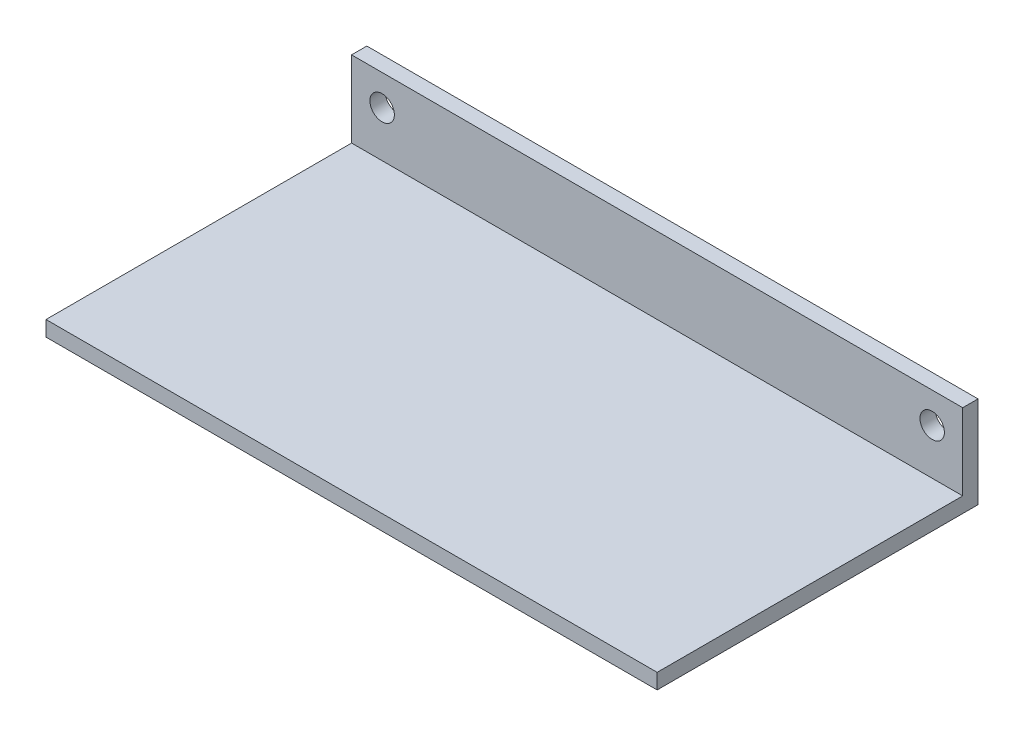
ISO-10303-21;
HEADER;
FILE_DESCRIPTION(('STEP AP214'),'2;1');
FILE_NAME('part.step','',(''),(''),'','','');
FILE_SCHEMA(('AUTOMOTIVE_DESIGN { 1 0 10303 214 1 1 1 1 }'));
ENDSEC;
DATA;
#1=APPLICATION_CONTEXT('core data for automotive mechanical design processes');
#2=APPLICATION_PROTOCOL_DEFINITION('international standard','automotive_design',2000,#1);
#3=PRODUCT_CONTEXT('',#1,'mechanical');
#4=PRODUCT('Part','Part','',(#3));
#5=PRODUCT_RELATED_PRODUCT_CATEGORY('part','',(#4));
#6=PRODUCT_DEFINITION_FORMATION('','',#4);
#7=PRODUCT_DEFINITION_CONTEXT('part definition',#1,'design');
#8=PRODUCT_DEFINITION('design','',#6,#7);
#9=PRODUCT_DEFINITION_SHAPE('','',#8);
#10=(LENGTH_UNIT() NAMED_UNIT(*) SI_UNIT(.MILLI.,.METRE.));
#11=(NAMED_UNIT(*) PLANE_ANGLE_UNIT() SI_UNIT($,.RADIAN.));
#12=(NAMED_UNIT(*) SI_UNIT($,.STERADIAN.) SOLID_ANGLE_UNIT());
#13=UNCERTAINTY_MEASURE_WITH_UNIT(LENGTH_MEASURE(1.E-05),#10,'distance_accuracy_value','');
#14=(GEOMETRIC_REPRESENTATION_CONTEXT(3) GLOBAL_UNCERTAINTY_ASSIGNED_CONTEXT((#13)) GLOBAL_UNIT_ASSIGNED_CONTEXT((#10,
#11,#12)) REPRESENTATION_CONTEXT('',''));
#15=CARTESIAN_POINT('',(0.,0.,0.));
#16=DIRECTION('',(0.,0.,1.));
#17=DIRECTION('',(1.,0.,0.));
#18=AXIS2_PLACEMENT_3D('',#15,#16,#17);
#19=CARTESIAN_POINT('',(100.,5.,50.));
#20=DIRECTION('',(-1.,0.,0.));
#21=DIRECTION('',(0.,0.,1.));
#22=AXIS2_PLACEMENT_3D('',#19,#20,#21);
#23=PLANE('',#22);
#24=DIRECTION('',(0.,0.,-1.));
#25=VECTOR('',#24,1.);
#26=CARTESIAN_POINT('',(100.,0.,50.));
#27=LINE('',#26,#25);
#28=CARTESIAN_POINT('',(100.,0.,50.));
#29=VERTEX_POINT('',#28);
#30=CARTESIAN_POINT('',(100.,0.,-55.));
#31=VERTEX_POINT('',#30);
#32=EDGE_CURVE('E88',#29,#31,#27,.T.);
#33=ORIENTED_EDGE('',*,*,#32,.T.);
#34=DIRECTION('',(0.,-1.,0.));
#35=VECTOR('',#34,1.);
#36=CARTESIAN_POINT('',(100.,30.,-55.));
#37=LINE('',#36,#35);
#38=CARTESIAN_POINT('',(100.,30.,-55.));
#39=VERTEX_POINT('',#38);
#40=EDGE_CURVE('E135',#39,#31,#37,.T.);
#41=ORIENTED_EDGE('',*,*,#40,.F.);
#42=DIRECTION('',(0.,0.,1.));
#43=VECTOR('',#42,1.);
#44=CARTESIAN_POINT('',(100.,30.,-50.));
#45=LINE('',#44,#43);
#46=CARTESIAN_POINT('',(100.,30.,-50.));
#47=VERTEX_POINT('',#46);
#48=EDGE_CURVE('E127',#39,#47,#45,.T.);
#49=ORIENTED_EDGE('',*,*,#48,.T.);
#50=DIRECTION('',(0.,-1.,0.));
#51=VECTOR('',#50,1.);
#52=CARTESIAN_POINT('',(100.,30.,-50.));
#53=LINE('',#52,#51);
#54=CARTESIAN_POINT('',(100.,5.,-50.));
#55=VERTEX_POINT('',#54);
#56=EDGE_CURVE('E89',#47,#55,#53,.T.);
#57=ORIENTED_EDGE('',*,*,#56,.T.);
#58=DIRECTION('',(0.,0.,-1.));
#59=VECTOR('',#58,1.);
#60=CARTESIAN_POINT('',(100.,5.,50.));
#61=LINE('',#60,#59);
#62=CARTESIAN_POINT('',(100.,5.,50.));
#63=VERTEX_POINT('',#62);
#64=EDGE_CURVE('E94',#63,#55,#61,.T.);
#65=ORIENTED_EDGE('',*,*,#64,.F.);
#66=DIRECTION('',(0.,-1.,0.));
#67=VECTOR('',#66,1.);
#68=CARTESIAN_POINT('',(100.,5.,50.));
#69=LINE('',#68,#67);
#70=EDGE_CURVE('E42',#63,#29,#69,.T.);
#71=ORIENTED_EDGE('',*,*,#70,.T.);
#72=EDGE_LOOP('',(#33,#41,#49,#57,#65,#71));
#73=FACE_BOUND('',#72,.T.);
#74=ADVANCED_FACE('F33',(#73),#23,.F.);
#75=CARTESIAN_POINT('',(-100.,5.,50.));
#76=DIRECTION('',(1.,0.,0.));
#77=DIRECTION('',(0.,0.,-1.));
#78=AXIS2_PLACEMENT_3D('',#75,#76,#77);
#79=PLANE('',#78);
#80=DIRECTION('',(0.,0.,1.));
#81=VECTOR('',#80,1.);
#82=CARTESIAN_POINT('',(-100.,0.,50.));
#83=LINE('',#82,#81);
#84=CARTESIAN_POINT('',(-100.,0.,-55.));
#85=VERTEX_POINT('',#84);
#86=CARTESIAN_POINT('',(-100.,0.,50.));
#87=VERTEX_POINT('',#86);
#88=EDGE_CURVE('E63',#85,#87,#83,.T.);
#89=ORIENTED_EDGE('',*,*,#88,.T.);
#90=DIRECTION('',(0.,-1.,0.));
#91=VECTOR('',#90,1.);
#92=CARTESIAN_POINT('',(-100.,5.,50.));
#93=LINE('',#92,#91);
#94=CARTESIAN_POINT('',(-100.,5.,50.));
#95=VERTEX_POINT('',#94);
#96=EDGE_CURVE('E11',#95,#87,#93,.T.);
#97=ORIENTED_EDGE('',*,*,#96,.F.);
#98=DIRECTION('',(0.,0.,1.));
#99=VECTOR('',#98,1.);
#100=CARTESIAN_POINT('',(-100.,5.,50.));
#101=LINE('',#100,#99);
#102=CARTESIAN_POINT('',(-100.,5.,-50.));
#103=VERTEX_POINT('',#102);
#104=EDGE_CURVE('E92',#103,#95,#101,.T.);
#105=ORIENTED_EDGE('',*,*,#104,.F.);
#106=DIRECTION('',(0.,-1.,0.));
#107=VECTOR('',#106,1.);
#108=CARTESIAN_POINT('',(-100.,30.,-50.));
#109=LINE('',#108,#107);
#110=CARTESIAN_POINT('',(-100.,30.,-50.));
#111=VERTEX_POINT('',#110);
#112=EDGE_CURVE('E81',#111,#103,#109,.T.);
#113=ORIENTED_EDGE('',*,*,#112,.F.);
#114=DIRECTION('',(0.,0.,-1.));
#115=VECTOR('',#114,1.);
#116=CARTESIAN_POINT('',(-100.,30.,-50.));
#117=LINE('',#116,#115);
#118=CARTESIAN_POINT('',(-100.,30.,-55.));
#119=VERTEX_POINT('',#118);
#120=EDGE_CURVE('E122',#111,#119,#117,.T.);
#121=ORIENTED_EDGE('',*,*,#120,.T.);
#122=DIRECTION('',(0.,-1.,0.));
#123=VECTOR('',#122,1.);
#124=CARTESIAN_POINT('',(-100.,30.,-55.));
#125=LINE('',#124,#123);
#126=EDGE_CURVE('E131',#119,#85,#125,.T.);
#127=ORIENTED_EDGE('',*,*,#126,.T.);
#128=EDGE_LOOP('',(#89,#97,#105,#113,#121,#127));
#129=FACE_BOUND('',#128,.T.);
#130=ADVANCED_FACE('F96',(#129),#79,.F.);
#131=CARTESIAN_POINT('',(-100.,5.,50.));
#132=DIRECTION('',(0.,0.,-1.));
#133=DIRECTION('',(-1.,0.,0.));
#134=AXIS2_PLACEMENT_3D('',#131,#132,#133);
#135=PLANE('',#134);
#136=DIRECTION('',(1.,0.,0.));
#137=VECTOR('',#136,1.);
#138=CARTESIAN_POINT('',(-100.,0.,50.));
#139=LINE('',#138,#137);
#140=EDGE_CURVE('E104',#87,#29,#139,.T.);
#141=ORIENTED_EDGE('',*,*,#140,.T.);
#142=ORIENTED_EDGE('',*,*,#70,.F.);
#143=DIRECTION('',(1.,0.,0.));
#144=VECTOR('',#143,1.);
#145=CARTESIAN_POINT('',(-100.,5.,50.));
#146=LINE('',#145,#144);
#147=EDGE_CURVE('E51',#95,#63,#146,.T.);
#148=ORIENTED_EDGE('',*,*,#147,.F.);
#149=ORIENTED_EDGE('',*,*,#96,.T.);
#150=EDGE_LOOP('',(#141,#142,#148,#149));
#151=FACE_BOUND('',#150,.T.);
#152=ADVANCED_FACE('F174',(#151),#135,.F.);
#153=CARTESIAN_POINT('',(0.,5.,0.));
#154=DIRECTION('',(0.,-1.,0.));
#155=DIRECTION('',(0.,0.,-1.));
#156=AXIS2_PLACEMENT_3D('',#153,#154,#155);
#157=PLANE('',#156);
#158=ORIENTED_EDGE('',*,*,#64,.T.);
#159=DIRECTION('',(-1.,0.,0.));
#160=VECTOR('',#159,1.);
#161=CARTESIAN_POINT('',(-100.,5.,-50.));
#162=LINE('',#161,#160);
#163=EDGE_CURVE('E72',#55,#103,#162,.T.);
#164=ORIENTED_EDGE('',*,*,#163,.T.);
#165=ORIENTED_EDGE('',*,*,#104,.T.);
#166=ORIENTED_EDGE('',*,*,#147,.T.);
#167=EDGE_LOOP('',(#158,#164,#165,#166));
#168=FACE_BOUND('',#167,.T.);
#169=ADVANCED_FACE('F91',(#168),#157,.F.);
#170=CARTESIAN_POINT('',(0.,0.,0.));
#171=DIRECTION('',(0.,-1.,0.));
#172=DIRECTION('',(0.,0.,-1.));
#173=AXIS2_PLACEMENT_3D('',#170,#171,#172);
#174=PLANE('',#173);
#175=ORIENTED_EDGE('',*,*,#32,.F.);
#176=ORIENTED_EDGE('',*,*,#140,.F.);
#177=ORIENTED_EDGE('',*,*,#88,.F.);
#178=DIRECTION('',(1.,0.,0.));
#179=VECTOR('',#178,1.);
#180=CARTESIAN_POINT('',(-100.,0.,-55.));
#181=LINE('',#180,#179);
#182=EDGE_CURVE('E113',#85,#31,#181,.T.);
#183=ORIENTED_EDGE('',*,*,#182,.T.);
#184=EDGE_LOOP('',(#175,#176,#177,#183));
#185=FACE_BOUND('',#184,.T.);
#186=ADVANCED_FACE('F148',(#185),#174,.T.);
#187=CARTESIAN_POINT('',(-100.,30.,-50.));
#188=DIRECTION('',(0.,0.,1.));
#189=DIRECTION('',(1.,0.,0.));
#190=AXIS2_PLACEMENT_3D('',#187,#188,#189);
#191=PLANE('',#190);
#192=CARTESIAN_POINT('',(-90.,20.,-50.));
#193=DIRECTION('',(0.,0.,1.));
#194=DIRECTION('',(1.,0.,0.));
#195=AXIS2_PLACEMENT_3D('',#192,#193,#194);
#196=CIRCLE('',#195,4.00000000000001);
#197=CARTESIAN_POINT('',(-86.,20.,-50.));
#198=VERTEX_POINT('',#197);
#199=EDGE_CURVE('E109',#198,#198,#196,.T.);
#200=ORIENTED_EDGE('',*,*,#199,.F.);
#201=EDGE_LOOP('',(#200));
#202=FACE_BOUND('',#201,.T.);
#203=CARTESIAN_POINT('',(90.,20.,-50.));
#204=DIRECTION('',(0.,0.,1.));
#205=DIRECTION('',(1.,0.,0.));
#206=AXIS2_PLACEMENT_3D('',#203,#204,#205);
#207=CIRCLE('',#206,4.00000000000001);
#208=CARTESIAN_POINT('',(94.,20.,-50.));
#209=VERTEX_POINT('',#208);
#210=EDGE_CURVE('E115',#209,#209,#207,.T.);
#211=ORIENTED_EDGE('',*,*,#210,.F.);
#212=EDGE_LOOP('',(#211));
#213=FACE_BOUND('',#212,.T.);
#214=ORIENTED_EDGE('',*,*,#163,.F.);
#215=ORIENTED_EDGE('',*,*,#56,.F.);
#216=DIRECTION('',(-1.,0.,0.));
#217=VECTOR('',#216,1.);
#218=CARTESIAN_POINT('',(-100.,30.,-50.));
#219=LINE('',#218,#217);
#220=EDGE_CURVE('E84',#47,#111,#219,.T.);
#221=ORIENTED_EDGE('',*,*,#220,.T.);
#222=ORIENTED_EDGE('',*,*,#112,.T.);
#223=EDGE_LOOP('',(#214,#215,#221,#222));
#224=FACE_BOUND('',#223,.T.);
#225=ADVANCED_FACE('F82',(#202,#213,#224),#191,.T.);
#226=CARTESIAN_POINT('',(-100.,30.,-55.));
#227=DIRECTION('',(0.,0.,-1.));
#228=DIRECTION('',(-1.,0.,0.));
#229=AXIS2_PLACEMENT_3D('',#226,#227,#228);
#230=PLANE('',#229);
#231=CARTESIAN_POINT('',(-90.,20.,-55.));
#232=DIRECTION('',(0.,0.,-1.));
#233=DIRECTION('',(-1.,0.,0.));
#234=AXIS2_PLACEMENT_3D('',#231,#232,#233);
#235=CIRCLE('',#234,4.00000000000001);
#236=CARTESIAN_POINT('',(-94.,20.,-55.));
#237=VERTEX_POINT('',#236);
#238=EDGE_CURVE('E36',#237,#237,#235,.T.);
#239=ORIENTED_EDGE('',*,*,#238,.F.);
#240=EDGE_LOOP('',(#239));
#241=FACE_BOUND('',#240,.T.);
#242=CARTESIAN_POINT('',(90.,20.,-55.));
#243=DIRECTION('',(0.,0.,-1.));
#244=DIRECTION('',(-1.,0.,0.));
#245=AXIS2_PLACEMENT_3D('',#242,#243,#244);
#246=CIRCLE('',#245,4.00000000000001);
#247=CARTESIAN_POINT('',(86.,20.,-55.));
#248=VERTEX_POINT('',#247);
#249=EDGE_CURVE('E107',#248,#248,#246,.T.);
#250=ORIENTED_EDGE('',*,*,#249,.F.);
#251=EDGE_LOOP('',(#250));
#252=FACE_BOUND('',#251,.T.);
#253=ORIENTED_EDGE('',*,*,#182,.F.);
#254=ORIENTED_EDGE('',*,*,#126,.F.);
#255=DIRECTION('',(1.,0.,0.));
#256=VECTOR('',#255,1.);
#257=CARTESIAN_POINT('',(-100.,30.,-55.));
#258=LINE('',#257,#256);
#259=EDGE_CURVE('E124',#119,#39,#258,.T.);
#260=ORIENTED_EDGE('',*,*,#259,.T.);
#261=ORIENTED_EDGE('',*,*,#40,.T.);
#262=EDGE_LOOP('',(#253,#254,#260,#261));
#263=FACE_BOUND('',#262,.T.);
#264=ADVANCED_FACE('F144',(#241,#252,#263),#230,.T.);
#265=CARTESIAN_POINT('',(0.,30.,0.));
#266=DIRECTION('',(0.,-1.,0.));
#267=DIRECTION('',(0.,0.,-1.));
#268=AXIS2_PLACEMENT_3D('',#265,#266,#267);
#269=PLANE('',#268);
#270=ORIENTED_EDGE('',*,*,#120,.F.);
#271=ORIENTED_EDGE('',*,*,#220,.F.);
#272=ORIENTED_EDGE('',*,*,#48,.F.);
#273=ORIENTED_EDGE('',*,*,#259,.F.);
#274=EDGE_LOOP('',(#270,#271,#272,#273));
#275=FACE_BOUND('',#274,.T.);
#276=ADVANCED_FACE('F157',(#275),#269,.F.);
#277=CARTESIAN_POINT('',(90.,20.,-90.));
#278=DIRECTION('',(0.,0.,1.));
#279=DIRECTION('',(1.,0.,0.));
#280=AXIS2_PLACEMENT_3D('',#277,#278,#279);
#281=CYLINDRICAL_SURFACE('',#280,4.00000000000001);
#282=ORIENTED_EDGE('',*,*,#249,.T.);
#283=EDGE_LOOP('',(#282));
#284=FACE_BOUND('',#283,.T.);
#285=ORIENTED_EDGE('',*,*,#210,.T.);
#286=EDGE_LOOP('',(#285));
#287=FACE_BOUND('',#286,.T.);
#288=ADVANCED_FACE('F159',(#284,#287),#281,.F.);
#289=CARTESIAN_POINT('',(-90.,20.,-90.));
#290=DIRECTION('',(0.,0.,1.));
#291=DIRECTION('',(1.,0.,0.));
#292=AXIS2_PLACEMENT_3D('',#289,#290,#291);
#293=CYLINDRICAL_SURFACE('',#292,4.00000000000001);
#294=ORIENTED_EDGE('',*,*,#238,.T.);
#295=EDGE_LOOP('',(#294));
#296=FACE_BOUND('',#295,.T.);
#297=ORIENTED_EDGE('',*,*,#199,.T.);
#298=EDGE_LOOP('',(#297));
#299=FACE_BOUND('',#298,.T.);
#300=ADVANCED_FACE('F165',(#296,#299),#293,.F.);
#301=CLOSED_SHELL('',(#74,#130,#152,#169,#186,#225,#264,#276,#288,#300));
#302=MANIFOLD_SOLID_BREP('B2',#301);
#303=ADVANCED_BREP_SHAPE_REPRESENTATION('',(#18,#302),#14);
#304=SHAPE_DEFINITION_REPRESENTATION(#9,#303);
ENDSEC;
END-ISO-10303-21;
